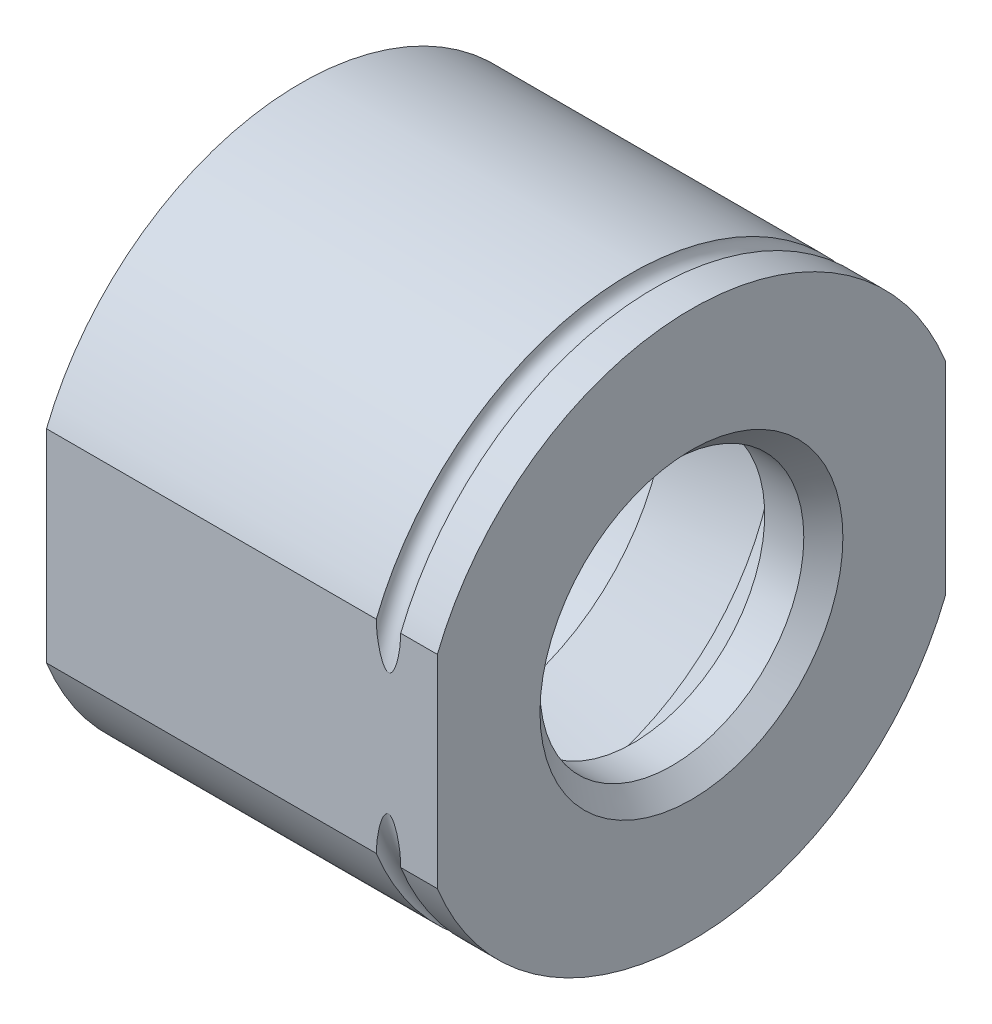
ISO-10303-21;
HEADER;
FILE_DESCRIPTION(('STEP AP214'),'2;1');
FILE_NAME('part.step','',(''),(''),'','','');
FILE_SCHEMA(('AUTOMOTIVE_DESIGN { 1 0 10303 214 1 1 1 1 }'));
ENDSEC;
DATA;
#1=APPLICATION_CONTEXT('core data for automotive mechanical design processes');
#2=APPLICATION_PROTOCOL_DEFINITION('international standard','automotive_design',2000,#1);
#3=PRODUCT_CONTEXT('',#1,'mechanical');
#4=PRODUCT('Part','Part','',(#3));
#5=PRODUCT_RELATED_PRODUCT_CATEGORY('part','',(#4));
#6=PRODUCT_DEFINITION_FORMATION('','',#4);
#7=PRODUCT_DEFINITION_CONTEXT('part definition',#1,'design');
#8=PRODUCT_DEFINITION('design','',#6,#7);
#9=PRODUCT_DEFINITION_SHAPE('','',#8);
#10=(LENGTH_UNIT() NAMED_UNIT(*) SI_UNIT(.MILLI.,.METRE.));
#11=(NAMED_UNIT(*) PLANE_ANGLE_UNIT() SI_UNIT($,.RADIAN.));
#12=(NAMED_UNIT(*) SI_UNIT($,.STERADIAN.) SOLID_ANGLE_UNIT());
#13=UNCERTAINTY_MEASURE_WITH_UNIT(LENGTH_MEASURE(1.E-05),#10,'distance_accuracy_value','');
#14=(GEOMETRIC_REPRESENTATION_CONTEXT(3) GLOBAL_UNCERTAINTY_ASSIGNED_CONTEXT((#13)) GLOBAL_UNIT_ASSIGNED_CONTEXT((#10,
#11,#12)) REPRESENTATION_CONTEXT('',''));
#15=CARTESIAN_POINT('',(0.,0.,0.));
#16=DIRECTION('',(0.,0.,1.));
#17=DIRECTION('',(1.,0.,0.));
#18=AXIS2_PLACEMENT_3D('',#15,#16,#17);
#19=CARTESIAN_POINT('',(-0.1016,0.,0.));
#20=DIRECTION('',(1.,0.,0.));
#21=DIRECTION('',(0.,0.,-1.));
#22=AXIS2_PLACEMENT_3D('',#19,#20,#21);
#23=CYLINDRICAL_SURFACE('',#22,1.42217319620361);
#24=DIRECTION('',(1.,0.,0.));
#25=VECTOR('',#24,1.);
#26=CARTESIAN_POINT('',(-0.1016,-0.527317703097479,-1.3208));
#27=LINE('',#26,#25);
#28=CARTESIAN_POINT('',(-0.1016,-0.527317703097479,-1.3208));
#29=VERTEX_POINT('',#28);
#30=CARTESIAN_POINT('',(1.6129,-0.527317703097479,-1.3208));
#31=VERTEX_POINT('',#30);
#32=EDGE_CURVE('E157',#29,#31,#27,.T.);
#33=ORIENTED_EDGE('',*,*,#32,.T.);
#34=CARTESIAN_POINT('',(1.6129,0.,0.));
#35=DIRECTION('',(-1.,0.,0.));
#36=DIRECTION('',(0.,0.,1.));
#37=AXIS2_PLACEMENT_3D('',#34,#35,#36);
#38=CIRCLE('',#37,1.42217319620361);
#39=CARTESIAN_POINT('',(1.6129,-0.527317703097479,1.3208));
#40=VERTEX_POINT('',#39);
#41=EDGE_CURVE('E78',#31,#40,#38,.T.);
#42=ORIENTED_EDGE('',*,*,#41,.T.);
#43=DIRECTION('',(1.,0.,0.));
#44=VECTOR('',#43,1.);
#45=CARTESIAN_POINT('',(-0.1016,-0.52731770309748,1.3208));
#46=LINE('',#45,#44);
#47=CARTESIAN_POINT('',(-0.1016,-0.52731770309748,1.3208));
#48=VERTEX_POINT('',#47);
#49=EDGE_CURVE('E149',#48,#40,#46,.T.);
#50=ORIENTED_EDGE('',*,*,#49,.F.);
#51=CARTESIAN_POINT('',(-0.1016,0.,0.));
#52=DIRECTION('',(1.,0.,0.));
#53=DIRECTION('',(0.,0.,-1.));
#54=AXIS2_PLACEMENT_3D('',#51,#52,#53);
#55=CIRCLE('',#54,1.42217319620361);
#56=EDGE_CURVE('E216',#48,#29,#55,.T.);
#57=ORIENTED_EDGE('',*,*,#56,.T.);
#58=EDGE_LOOP('',(#33,#42,#50,#57));
#59=FACE_BOUND('',#58,.T.);
#60=ADVANCED_FACE('F49',(#59),#23,.T.);
#61=CARTESIAN_POINT('',(1.7399,-0.527317703097479,1.3208));
#62=VERTEX_POINT('',#61);
#63=CARTESIAN_POINT('',(1.9304,-0.52731770309748,1.3208));
#64=VERTEX_POINT('',#63);
#65=EDGE_CURVE('E144',#62,#64,#46,.T.);
#66=ORIENTED_EDGE('',*,*,#65,.F.);
#67=CARTESIAN_POINT('',(1.7399,0.,0.));
#68=DIRECTION('',(-1.,0.,0.));
#69=DIRECTION('',(0.,0.,1.));
#70=AXIS2_PLACEMENT_3D('',#67,#68,#69);
#71=CIRCLE('',#70,1.42217319620361);
#72=CARTESIAN_POINT('',(1.7399,-0.527317703097479,-1.3208));
#73=VERTEX_POINT('',#72);
#74=EDGE_CURVE('E125',#73,#62,#71,.T.);
#75=ORIENTED_EDGE('',*,*,#74,.F.);
#76=CARTESIAN_POINT('',(1.9304,-0.527317703097479,-1.3208));
#77=VERTEX_POINT('',#76);
#78=EDGE_CURVE('E161',#73,#77,#27,.T.);
#79=ORIENTED_EDGE('',*,*,#78,.T.);
#80=CARTESIAN_POINT('',(1.9304,0.,0.));
#81=DIRECTION('',(1.,0.,0.));
#82=DIRECTION('',(0.,0.,-1.));
#83=AXIS2_PLACEMENT_3D('',#80,#81,#82);
#84=CIRCLE('',#83,1.42217319620361);
#85=EDGE_CURVE('E237',#64,#77,#84,.T.);
#86=ORIENTED_EDGE('',*,*,#85,.F.);
#87=EDGE_LOOP('',(#66,#75,#79,#86));
#88=FACE_BOUND('',#87,.T.);
#89=ADVANCED_FACE('F198',(#88),#23,.T.);
#90=CARTESIAN_POINT('',(-0.1016,0.527317703097479,1.3208));
#91=DIRECTION('',(0.,0.,1.));
#92=DIRECTION('',(1.,0.,0.));
#93=AXIS2_PLACEMENT_3D('',#90,#91,#92);
#94=PLANE('',#93);
#95=ORIENTED_EDGE('',*,*,#49,.T.);
#96=CARTESIAN_POINT('',(1.61327079992272,-0.508547522095153,1.3208));
#97=CARTESIAN_POINT('',(1.61410123201116,-0.487117532428304,1.3208));
#98=CARTESIAN_POINT('',(1.61627975921256,-0.465731752126961,1.3208));
#99=CARTESIAN_POINT('',(1.62138185103183,-0.43403056999215,1.3208));
#100=CARTESIAN_POINT('',(1.62338067178202,-0.423553308196953,1.3208));
#101=CARTESIAN_POINT('',(1.6280638385165,-0.40275481452524,1.3208));
#102=CARTESIAN_POINT('',(1.63074748955529,-0.392433435643484,1.3208));
#103=CARTESIAN_POINT('',(1.63546256570793,-0.377157917856461,1.3208));
#104=CARTESIAN_POINT('',(1.63715079474963,-0.372096594956818,1.3208));
#105=CARTESIAN_POINT('',(1.64084418063288,-0.362035815694534,1.3208));
#106=CARTESIAN_POINT('',(1.64285187204038,-0.357037231812776,1.3208));
#107=CARTESIAN_POINT('',(1.64733748589652,-0.347163535147122,1.3208));
#108=CARTESIAN_POINT('',(1.6498228688843,-0.342292000237766,1.3208));
#109=CARTESIAN_POINT('',(1.65551789037958,-0.332993263390576,1.3208));
#110=CARTESIAN_POINT('',(1.65871512718782,-0.328560135874237,1.3208));
#111=CARTESIAN_POINT('',(1.66355153874089,-0.324092145241062,1.3208));
#112=CARTESIAN_POINT('',(1.66447215226297,-0.323315443093113,1.3208));
#113=CARTESIAN_POINT('',(1.66640611453267,-0.321885735749664,1.3208));
#114=CARTESIAN_POINT('',(1.66741939369593,-0.321232638849707,1.3208));
#115=CARTESIAN_POINT('',(1.66933457313446,-0.320212696229645,1.3208));
#116=CARTESIAN_POINT('',(1.67021967432656,-0.319814866871306,1.3208));
#117=CARTESIAN_POINT('',(1.67204336047278,-0.319169284045743,1.3208));
#118=CARTESIAN_POINT('',(1.67298187194669,-0.318921329597116,1.3208));
#119=CARTESIAN_POINT('',(1.67489853209757,-0.31860428130753,1.3208));
#120=CARTESIAN_POINT('',(1.67587696392344,-0.318536837001317,1.3208));
#121=CARTESIAN_POINT('',(1.6778279065595,-0.318596097305675,1.3208));
#122=CARTESIAN_POINT('',(1.67880041661686,-0.318722826104412,1.3208));
#123=CARTESIAN_POINT('',(1.68058110971126,-0.319123573140062,1.3208));
#124=CARTESIAN_POINT('',(1.68139427801942,-0.31937642129739,1.3208));
#125=CARTESIAN_POINT('',(1.68297719383,-0.319992068501384,1.3208));
#126=CARTESIAN_POINT('',(1.6837469271034,-0.32035490333377,1.3208));
#127=CARTESIAN_POINT('',(1.68583739449962,-0.321492748366657,1.3208));
#128=CARTESIAN_POINT('',(1.68710485717128,-0.322364926868196,1.3208));
#129=CARTESIAN_POINT('',(1.68949839228136,-0.324285987804103,1.3208));
#130=CARTESIAN_POINT('',(1.69062389690994,-0.32533554287112,1.3208));
#131=CARTESIAN_POINT('',(1.69453607099004,-0.329374208686222,1.3208));
#132=CARTESIAN_POINT('',(1.69697751862376,-0.332689849075709,1.3208));
#133=CARTESIAN_POINT('',(1.70140708767815,-0.339609050012254,1.3208));
#134=CARTESIAN_POINT('',(1.70339208654412,-0.343214378586629,1.3208));
#135=CARTESIAN_POINT('',(1.70849759214814,-0.353443475618988,1.3208));
#136=CARTESIAN_POINT('',(1.71129602549062,-0.360228017415612,1.3208));
#137=CARTESIAN_POINT('',(1.71634479352295,-0.374001911644827,1.3208));
#138=CARTESIAN_POINT('',(1.71859370105788,-0.380991745647059,1.3208));
#139=CARTESIAN_POINT('',(1.72474020076049,-0.402145630129789,1.3208));
#140=CARTESIAN_POINT('',(1.72803340348204,-0.416484107399889,1.3208));
#141=CARTESIAN_POINT('',(1.73513153059778,-0.454348461118436,1.3208));
#142=CARTESIAN_POINT('',(1.73798650861486,-0.478055670215293,1.3208));
#143=CARTESIAN_POINT('',(1.73984052272239,-0.513721793580453,1.3208));
#144=CARTESIAN_POINT('',(1.74005388079704,-0.525626911185022,1.3208));
#145=CARTESIAN_POINT('',(1.7395168114693,-0.549412241893194,1.3208));
#146=CARTESIAN_POINT('',(1.73876746706724,-0.561292467948864,1.3208));
#147=CARTESIAN_POINT('',(1.73605017088207,-0.584950225018887,1.3208));
#148=CARTESIAN_POINT('',(1.73407846157779,-0.59672732539105,1.3208));
#149=CARTESIAN_POINT('',(1.72844424004516,-0.619887584482973,1.3208));
#150=CARTESIAN_POINT('',(1.72478991637334,-0.631272367255924,1.3208));
#151=CARTESIAN_POINT('',(1.71777383883732,-0.646241796367567,1.3208));
#152=CARTESIAN_POINT('',(1.71558154923911,-0.650365509435319,1.3208));
#153=CARTESIAN_POINT('',(1.71063667861031,-0.658260671854208,1.3208));
#154=CARTESIAN_POINT('',(1.70788637979442,-0.662033467580182,1.3208));
#155=CARTESIAN_POINT('',(1.70322222151157,-0.667209140761892,1.3208));
#156=CARTESIAN_POINT('',(1.701577896881,-0.668853646605565,1.3208));
#157=CARTESIAN_POINT('',(1.69808701509341,-0.671916081855663,1.3208));
#158=CARTESIAN_POINT('',(1.69624056819383,-0.673334133764535,1.3208));
#159=CARTESIAN_POINT('',(1.6926487891476,-0.675652533599948,1.3208));
#160=CARTESIAN_POINT('',(1.69093384795163,-0.67659931727464,1.3208));
#161=CARTESIAN_POINT('',(1.68737123338554,-0.67819930062222,1.3208));
#162=CARTESIAN_POINT('',(1.68552371641722,-0.678852839844647,1.3208));
#163=CARTESIAN_POINT('',(1.68171662867276,-0.679806399311097,1.3208));
#164=CARTESIAN_POINT('',(1.67975609549563,-0.680102687865833,1.3208));
#165=CARTESIAN_POINT('',(1.67581590524519,-0.680290279669111,1.3208));
#166=CARTESIAN_POINT('',(1.67383625938927,-0.680181807588212,1.3208));
#167=CARTESIAN_POINT('',(1.67024805390029,-0.679623931165019,1.3208));
#168=CARTESIAN_POINT('',(1.66863023861206,-0.679231037190397,1.3208));
#169=CARTESIAN_POINT('',(1.66547408176581,-0.678203392193641,1.3208));
#170=CARTESIAN_POINT('',(1.66393577656426,-0.677568531622616,1.3208));
#171=CARTESIAN_POINT('',(1.66025280634761,-0.675749674245639,1.3208));
#172=CARTESIAN_POINT('',(1.65816649669648,-0.67444803407407,1.3208));
#173=CARTESIAN_POINT('',(1.65422388166049,-0.671534214061854,1.3208));
#174=CARTESIAN_POINT('',(1.65236819178269,-0.669921231339192,1.3208));
#175=CARTESIAN_POINT('',(1.64768232182192,-0.665311077877855,1.3208));
#176=CARTESIAN_POINT('',(1.64504663381851,-0.662118019121602,1.3208));
#177=CARTESIAN_POINT('',(1.64026121906108,-0.655390452389046,1.3208));
#178=CARTESIAN_POINT('',(1.6381128481809,-0.651855029867408,1.3208));
#179=CARTESIAN_POINT('',(1.63218358567242,-0.640837936272729,1.3208));
#180=CARTESIAN_POINT('',(1.62899800247397,-0.633039490343991,1.3208));
#181=CARTESIAN_POINT('',(1.62368461339166,-0.617105700358118,1.3208));
#182=CARTESIAN_POINT('',(1.62155927700831,-0.608969617145235,1.3208));
#183=CARTESIAN_POINT('',(1.61663542783838,-0.585667721092861,1.3208));
#184=CARTESIAN_POINT('',(1.6147583774152,-0.570308703343404,1.3208));
#185=CARTESIAN_POINT('',(1.61277412663641,-0.539474773389508,1.3208));
#186=CARTESIAN_POINT('',(1.61267201535307,-0.52399965517009,1.3208));
#187=CARTESIAN_POINT('',(1.61327079992272,-0.508547522095153,1.3208));
#188=B_SPLINE_CURVE_WITH_KNOTS('',3,(#96,#97,#98,#99,#100,#101,#102,#103,#104,#105,#106,#107,
#108,#109,#110,#111,#112,#113,#114,#115,#116,#117,#118,#119,#120,#121,#122,#123,#124,#125,#126,
#127,#128,#129,#130,#131,#132,#133,#134,#135,#136,#137,#138,#139,#140,#141,#142,#143,#144,#145,
#146,#147,#148,#149,#150,#151,#152,#153,#154,#155,#156,#157,#158,#159,#160,#161,#162,#163,#164,
#165,#166,#167,#168,#169,#170,#171,#172,#173,#174,#175,#176,#177,#178,#179,#180,#181,#182,#183,
#184,#185,#186,#187),.UNSPECIFIED.,.T.,.F.,(4,2,2,2,2,2,2,2,2,2,2,2,2,2,2,2,2,2,2,2,2,2,2,2,2,2,
2,2,2,2,2,2,2,2,2,2,2,2,2,2,2,2,2,2,2,4),(0.,0.0643073680607315,0.0962943489159922,
0.128248998519312,0.144251576543813,0.160388104592895,0.176800834812584,0.192947342405822,
0.196553171577012,0.200156314955245,0.203056997418373,0.205953781402805,0.208876947765127,
0.211800478296221,0.214345885258932,0.216892121296326,0.221480731385624,0.226087149373269,
0.23834313845857,0.25068062907585,0.272641967714072,0.294659749257538,0.338727473877869,
0.410133303602389,0.445829402124988,0.481485379159332,0.517251509054085,0.552845390980571,
0.566828442449786,0.580755417192942,0.587717596303352,0.594675996303287,0.600531048279229,
0.606379303048142,0.612288131214861,0.618193680055287,0.623167172558658,0.628142919460163,
0.635478044167202,0.642832343504145,0.655183169500038,0.667567949113089,0.692698394737571,
0.717887103422975,0.764123501932235,0.810492446781076),.UNSPECIFIED.);
#189=EDGE_CURVE('E137',#40,#62,#188,.T.);
#190=ORIENTED_EDGE('',*,*,#189,.T.);
#191=ORIENTED_EDGE('',*,*,#65,.T.);
#192=DIRECTION('',(0.,-1.,0.));
#193=VECTOR('',#192,1.);
#194=CARTESIAN_POINT('',(1.9304,0.527317703097479,1.3208));
#195=LINE('',#194,#193);
#196=CARTESIAN_POINT('',(1.9304,0.527317703097479,1.3208));
#197=VERTEX_POINT('',#196);
#198=EDGE_CURVE('E231',#197,#64,#195,.T.);
#199=ORIENTED_EDGE('',*,*,#198,.F.);
#200=DIRECTION('',(1.,0.,0.));
#201=VECTOR('',#200,1.);
#202=CARTESIAN_POINT('',(-0.1016,0.527317703097479,1.3208));
#203=LINE('',#202,#201);
#204=CARTESIAN_POINT('',(1.7399,0.527317703097479,1.3208));
#205=VERTEX_POINT('',#204);
#206=EDGE_CURVE('E135',#205,#197,#203,.T.);
#207=ORIENTED_EDGE('',*,*,#206,.F.);
#208=CARTESIAN_POINT('',(1.67485270124336,0.318639997408028,1.3208));
#209=CARTESIAN_POINT('',(1.67386687935229,0.318742412070862,1.3208));
#210=CARTESIAN_POINT('',(1.67289151287556,0.318942869633638,1.3208));
#211=CARTESIAN_POINT('',(1.6709909606494,0.319511944215622,1.3208));
#212=CARTESIAN_POINT('',(1.67006588305181,0.319880908769566,1.3208));
#213=CARTESIAN_POINT('',(1.6679035724575,0.320931599129008,1.3208));
#214=CARTESIAN_POINT('',(1.66669910547798,0.321679602685286,1.3208));
#215=CARTESIAN_POINT('',(1.66441676867692,0.323347044128238,1.3208));
#216=CARTESIAN_POINT('',(1.66333922271222,0.324266905718393,1.3208));
#217=CARTESIAN_POINT('',(1.65976205630876,0.32766536088741,1.3208));
#218=CARTESIAN_POINT('',(1.65753516851105,0.330424700878596,1.3208));
#219=CARTESIAN_POINT('',(1.65347270508397,0.336217653500864,1.3208));
#220=CARTESIAN_POINT('',(1.65163986768691,0.339252989168973,1.3208));
#221=CARTESIAN_POINT('',(1.64700788868944,0.347708258443656,1.3208));
#222=CARTESIAN_POINT('',(1.64446576005205,0.353268484780056,1.3208));
#223=CARTESIAN_POINT('',(1.63984056234651,0.364579721034463,1.3208));
#224=CARTESIAN_POINT('',(1.63775868854174,0.370331184091349,1.3208));
#225=CARTESIAN_POINT('',(1.63200180210707,0.387759239285524,1.3208));
#226=CARTESIAN_POINT('',(1.62882028640237,0.399599160587468,1.3208));
#227=CARTESIAN_POINT('',(1.62337439221561,0.423408202017514,1.3208));
#228=CARTESIAN_POINT('',(1.6211051949246,0.435376291119901,1.3208));
#229=CARTESIAN_POINT('',(1.61736768752501,0.459452231922754,1.3208));
#230=CARTESIAN_POINT('',(1.61590027771416,0.471560225208688,1.3208));
#231=CARTESIAN_POINT('',(1.61378576345627,0.495846706802483,1.3208));
#232=CARTESIAN_POINT('',(1.61313859737155,0.508025189744261,1.3208));
#233=CARTESIAN_POINT('',(1.61276954310186,0.532395607084063,1.3208));
#234=CARTESIAN_POINT('',(1.61304713822346,0.544587530166974,1.3208));
#235=CARTESIAN_POINT('',(1.61485487416913,0.570648211961541,1.3208));
#236=CARTESIAN_POINT('',(1.61656016285556,0.584504779766506,1.3208));
#237=CARTESIAN_POINT('',(1.62201897244385,0.611814654817939,1.3208));
#238=CARTESIAN_POINT('',(1.62575875685203,0.625270035234794,1.3208));
#239=CARTESIAN_POINT('',(1.63311094710097,0.642331980961519,1.3208));
#240=CARTESIAN_POINT('',(1.63518503453793,0.646588546940789,1.3208));
#241=CARTESIAN_POINT('',(1.63986818218345,0.654797709817243,1.3208));
#242=CARTESIAN_POINT('',(1.64247577349738,0.658751101208217,1.3208));
#243=CARTESIAN_POINT('',(1.64704690388863,0.6644455139038,1.3208));
#244=CARTESIAN_POINT('',(1.64876911710487,0.666379074235364,1.3208));
#245=CARTESIAN_POINT('',(1.65245364028426,0.67000652980535,1.3208));
#246=CARTESIAN_POINT('',(1.65441576698252,0.671700605874049,1.3208));
#247=CARTESIAN_POINT('',(1.6581541374291,0.674416076951593,1.3208));
#248=CARTESIAN_POINT('',(1.6598815407574,0.675503937414628,1.3208));
#249=CARTESIAN_POINT('',(1.66348905051617,0.677388437120524,1.3208));
#250=CARTESIAN_POINT('',(1.66536888772262,0.678185576698707,1.3208));
#251=CARTESIAN_POINT('',(1.66891061067837,0.679306623474783,1.3208));
#252=CARTESIAN_POINT('',(1.67055396687525,0.679688530183748,1.3208));
#253=CARTESIAN_POINT('',(1.67388169024811,0.68016817357055,1.3208));
#254=CARTESIAN_POINT('',(1.67556603050335,0.680266091964701,1.3208));
#255=CARTESIAN_POINT('',(1.67892664750177,0.680168318935855,1.3208));
#256=CARTESIAN_POINT('',(1.68060292078759,0.679972511225546,1.3208));
#257=CARTESIAN_POINT('',(1.68389973751802,0.679306007919346,1.3208));
#258=CARTESIAN_POINT('',(1.68552023645758,0.678835097955042,1.3208));
#259=CARTESIAN_POINT('',(1.68913419244172,0.677483140695746,1.3208));
#260=CARTESIAN_POINT('',(1.69109759177292,0.676522300117137,1.3208));
#261=CARTESIAN_POINT('',(1.69484426913914,0.674298516253261,1.3208));
#262=CARTESIAN_POINT('',(1.69662717239449,0.673034962006437,1.3208));
#263=CARTESIAN_POINT('',(1.70098712123166,0.669497818975332,1.3208));
#264=CARTESIAN_POINT('',(1.70343086447325,0.667061385910786,1.3208));
#265=CARTESIAN_POINT('',(1.70793170846882,0.661856923542702,1.3208));
#266=CARTESIAN_POINT('',(1.70998773326133,0.659088005377836,1.3208));
#267=CARTESIAN_POINT('',(1.7155406576783,0.650683494144398,1.3208));
#268=CARTESIAN_POINT('',(1.71860883735985,0.644767620085065,1.3208));
#269=CARTESIAN_POINT('',(1.7239154669005,0.632588373320861,1.3208));
#270=CARTESIAN_POINT('',(1.72615221175215,0.626324316495643,1.3208));
#271=CARTESIAN_POINT('',(1.73235119315264,0.605922326338034,1.3208));
#272=CARTESIAN_POINT('',(1.73512621212539,0.591428690876174,1.3208));
#273=CARTESIAN_POINT('',(1.73880530862914,0.562169813958327,1.3208));
#274=CARTESIAN_POINT('',(1.73969710334,0.547403419225165,1.3208));
#275=CARTESIAN_POINT('',(1.74004019012186,0.517947737283945,1.3208));
#276=CARTESIAN_POINT('',(1.7395003636086,0.503258538487747,1.3208));
#277=CARTESIAN_POINT('',(1.73722348673311,0.473972425036437,1.3208));
#278=CARTESIAN_POINT('',(1.73548610614998,0.459375536956306,1.3208));
#279=CARTESIAN_POINT('',(1.73085795576051,0.430483409135114,1.3208));
#280=CARTESIAN_POINT('',(1.72797594151972,0.416186727586896,1.3208));
#281=CARTESIAN_POINT('',(1.7208916075669,0.38793826477456,1.3208));
#282=CARTESIAN_POINT('',(1.71669406773519,0.37398542906251,1.3208));
#283=CARTESIAN_POINT('',(1.71016635336418,0.357711152939245,1.3208));
#284=CARTESIAN_POINT('',(1.70899430032861,0.354938760191774,1.3208));
#285=CARTESIAN_POINT('',(1.70650600989737,0.349459448066692,1.3208));
#286=CARTESIAN_POINT('',(1.70518952407086,0.346752651595668,1.3208));
#287=CARTESIAN_POINT('',(1.70080069063145,0.338394182886188,1.3208));
#288=CARTESIAN_POINT('',(1.69742000331662,0.332857472000263,1.3208));
#289=CARTESIAN_POINT('',(1.69231820163847,0.327076676955551,1.3208));
#290=CARTESIAN_POINT('',(1.69141952774781,0.326129138198481,1.3208));
#291=CARTESIAN_POINT('',(1.68952731085036,0.324328750697798,1.3208));
#292=CARTESIAN_POINT('',(1.68853360723617,0.323476067721503,1.3208));
#293=CARTESIAN_POINT('',(1.68642302544908,0.321899535857425,1.3208));
#294=CARTESIAN_POINT('',(1.68530454366573,0.321177777673098,1.3208));
#295=CARTESIAN_POINT('',(1.68295252344134,0.319956273786091,1.3208));
#296=CARTESIAN_POINT('',(1.68171951920497,0.319455554327663,1.3208));
#297=CARTESIAN_POINT('',(1.67953604706088,0.318862173137515,1.3208));
#298=CARTESIAN_POINT('',(1.67860652234646,0.318693510335914,1.3208));
#299=CARTESIAN_POINT('',(1.67673242080308,0.318533919329986,1.3208));
#300=CARTESIAN_POINT('',(1.67578785686291,0.31854284634216,1.3208));
#301=CARTESIAN_POINT('',(1.67485270124336,0.318639997408028,1.3208));
#302=B_SPLINE_CURVE_WITH_KNOTS('',3,(#208,#209,#210,#211,#212,#213,#214,#215,#216,#217,#218,
#219,#220,#221,#222,#223,#224,#225,#226,#227,#228,#229,#230,#231,#232,#233,#234,#235,#236,#237,
#238,#239,#240,#241,#242,#243,#244,#245,#246,#247,#248,#249,#250,#251,#252,#253,#254,#255,#256,
#257,#258,#259,#260,#261,#262,#263,#264,#265,#266,#267,#268,#269,#270,#271,#272,#273,#274,#275,
#276,#277,#278,#279,#280,#281,#282,#283,#284,#285,#286,#287,#288,#289,#290,#291,#292,#293,#294,
#295,#296,#297,#298,#299,#300,#301),.UNSPECIFIED.,.T.,.F.,(4,2,2,2,2,2,2,2,2,2,2,2,2,2,2,2,2,2,
2,2,2,2,2,2,2,2,2,2,2,2,2,2,2,2,2,2,2,2,2,2,2,2,2,2,2,2,4),(0.,0.00296910834186236,
0.0059443681251479,0.0101736245207005,0.0144134488285887,0.0249691033128915,0.0355958935418746,
0.0538905174271889,0.0722321077251544,0.108949214530345,0.145469752273428,0.182031213754402,
0.218589927640682,0.255128218439543,0.296944773291562,0.33848243356271,0.35266283998346,
0.366804716616884,0.374556973965302,0.382303346094276,0.388406746755628,0.394499593237477,
0.399538750624888,0.404574682881903,0.409612609410458,0.414654466897612,0.421175477156502,
0.427709761205372,0.438003659392266,0.448325716911143,0.468205904282348,0.488126637559675,
0.532152778338705,0.576465191910785,0.620503346532936,0.664553649366529,0.708273297856483,
0.75183590021912,0.760859512587428,0.76989889679905,0.789113784323038,0.793026381943539,
0.796945713118461,0.800922978837073,0.804882544010865,0.807701353157664,0.81051786431053),.UNSPECIFIED.);
#303=CARTESIAN_POINT('',(1.6129,0.527317703097479,1.3208));
#304=VERTEX_POINT('',#303);
#305=EDGE_CURVE('E120',#205,#304,#302,.T.);
#306=ORIENTED_EDGE('',*,*,#305,.T.);
#307=CARTESIAN_POINT('',(-0.1016,0.527317703097479,1.3208));
#308=VERTEX_POINT('',#307);
#309=EDGE_CURVE('E132',#308,#304,#203,.T.);
#310=ORIENTED_EDGE('',*,*,#309,.F.);
#311=DIRECTION('',(0.,-1.,0.));
#312=VECTOR('',#311,1.);
#313=CARTESIAN_POINT('',(-0.1016,0.527317703097479,1.3208));
#314=LINE('',#313,#312);
#315=EDGE_CURVE('E229',#308,#48,#314,.T.);
#316=ORIENTED_EDGE('',*,*,#315,.T.);
#317=EDGE_LOOP('',(#95,#190,#191,#199,#207,#306,#310,#316));
#318=FACE_BOUND('',#317,.T.);
#319=ADVANCED_FACE('F130',(#318),#94,.T.);
#320=CARTESIAN_POINT('',(-0.1016,0.,0.));
#321=DIRECTION('',(1.,0.,0.));
#322=DIRECTION('',(0.,0.,-1.));
#323=AXIS2_PLACEMENT_3D('',#320,#321,#322);
#324=CYLINDRICAL_SURFACE('',#323,1.42217319620361);
#325=ORIENTED_EDGE('',*,*,#309,.T.);
#326=CARTESIAN_POINT('',(1.6129,0.527317703097479,-1.3208));
#327=VERTEX_POINT('',#326);
#328=EDGE_CURVE('E117',#304,#327,#38,.T.);
#329=ORIENTED_EDGE('',*,*,#328,.T.);
#330=DIRECTION('',(1.,0.,0.));
#331=VECTOR('',#330,1.);
#332=CARTESIAN_POINT('',(-0.1016,0.52731770309748,-1.3208));
#333=LINE('',#332,#331);
#334=CARTESIAN_POINT('',(-0.1016,0.52731770309748,-1.3208));
#335=VERTEX_POINT('',#334);
#336=EDGE_CURVE('E151',#335,#327,#333,.T.);
#337=ORIENTED_EDGE('',*,*,#336,.F.);
#338=CARTESIAN_POINT('',(-0.1016,0.,0.));
#339=DIRECTION('',(1.,0.,0.));
#340=DIRECTION('',(0.,0.,-1.));
#341=AXIS2_PLACEMENT_3D('',#338,#339,#340);
#342=CIRCLE('',#341,1.42217319620361);
#343=EDGE_CURVE('E141',#335,#308,#342,.T.);
#344=ORIENTED_EDGE('',*,*,#343,.T.);
#345=EDGE_LOOP('',(#325,#329,#337,#344));
#346=FACE_BOUND('',#345,.T.);
#347=ADVANCED_FACE('F139',(#346),#324,.T.);
#348=CARTESIAN_POINT('',(1.7399,0.52731770309748,-1.3208));
#349=VERTEX_POINT('',#348);
#350=CARTESIAN_POINT('',(1.9304,0.52731770309748,-1.3208));
#351=VERTEX_POINT('',#350);
#352=EDGE_CURVE('E156',#349,#351,#333,.T.);
#353=ORIENTED_EDGE('',*,*,#352,.F.);
#354=EDGE_CURVE('E70',#205,#349,#71,.T.);
#355=ORIENTED_EDGE('',*,*,#354,.F.);
#356=ORIENTED_EDGE('',*,*,#206,.T.);
#357=CARTESIAN_POINT('',(1.9304,0.,0.));
#358=DIRECTION('',(1.,0.,0.));
#359=DIRECTION('',(0.,0.,-1.));
#360=AXIS2_PLACEMENT_3D('',#357,#358,#359);
#361=CIRCLE('',#360,1.42217319620361);
#362=EDGE_CURVE('E246',#351,#197,#361,.T.);
#363=ORIENTED_EDGE('',*,*,#362,.F.);
#364=EDGE_LOOP('',(#353,#355,#356,#363));
#365=FACE_BOUND('',#364,.T.);
#366=ADVANCED_FACE('F203',(#365),#324,.T.);
#367=CARTESIAN_POINT('',(-0.1016,-0.527317703097479,-1.3208));
#368=DIRECTION('',(0.,0.,-1.));
#369=DIRECTION('',(-1.,0.,0.));
#370=AXIS2_PLACEMENT_3D('',#367,#368,#369);
#371=PLANE('',#370);
#372=ORIENTED_EDGE('',*,*,#78,.F.);
#373=CARTESIAN_POINT('',(1.61327079992272,-0.508547522095152,-1.3208));
#374=CARTESIAN_POINT('',(1.61261675839651,-0.525415150751983,-1.3208));
#375=CARTESIAN_POINT('',(1.61279822570286,-0.542310168696948,-1.3208));
#376=CARTESIAN_POINT('',(1.61533279389331,-0.57600415215576,-1.3208));
#377=CARTESIAN_POINT('',(1.6176855526725,-0.592803132381609,-1.3208));
#378=CARTESIAN_POINT('',(1.62380091420713,-0.61742472619507,-1.3208));
#379=CARTESIAN_POINT('',(1.62628316317367,-0.62556216477486,-1.3208));
#380=CARTESIAN_POINT('',(1.63247664988756,-0.641362607602067,-1.3208));
#381=CARTESIAN_POINT('',(1.63618054255279,-0.649028130045487,-1.3208));
#382=CARTESIAN_POINT('',(1.64275183345288,-0.659005414192534,-1.3208));
#383=CARTESIAN_POINT('',(1.64483893368214,-0.66182363839497,-1.3208));
#384=CARTESIAN_POINT('',(1.64941445650297,-0.667113124486188,-1.3208));
#385=CARTESIAN_POINT('',(1.6519014298823,-0.669585581172132,-1.3208));
#386=CARTESIAN_POINT('',(1.65619095129826,-0.673039834902514,-1.3208));
#387=CARTESIAN_POINT('',(1.65784024417646,-0.674210725154705,-1.3208));
#388=CARTESIAN_POINT('',(1.66129570582234,-0.676297390403908,-1.3208));
#389=CARTESIAN_POINT('',(1.6631018161375,-0.677213259927004,-1.3208));
#390=CARTESIAN_POINT('',(1.66687391620868,-0.678723598499577,-1.3208));
#391=CARTESIAN_POINT('',(1.66884164177121,-0.679313848179492,-1.3208));
#392=CARTESIAN_POINT('',(1.67285537887436,-0.680082822674359,-1.3208));
#393=CARTESIAN_POINT('',(1.67490124875669,-0.680262259269559,-1.3208));
#394=CARTESIAN_POINT('',(1.67867023877508,-0.680192471923984,-1.3208));
#395=CARTESIAN_POINT('',(1.68039477795226,-0.680004718614173,-1.3208));
#396=CARTESIAN_POINT('',(1.68378656912692,-0.679337886354141,-1.3208));
#397=CARTESIAN_POINT('',(1.68545377862022,-0.678858595977387,-1.3208));
#398=CARTESIAN_POINT('',(1.68911066849086,-0.677493634492949,-1.3208));
#399=CARTESIAN_POINT('',(1.69107288716969,-0.676535114722883,-1.3208));
#400=CARTESIAN_POINT('',(1.69481745730647,-0.674316263426883,-1.3208));
#401=CARTESIAN_POINT('',(1.69659945978365,-0.673055361680976,-1.3208));
#402=CARTESIAN_POINT('',(1.70095678358107,-0.66952567836429,-1.3208));
#403=CARTESIAN_POINT('',(1.70339913644134,-0.667094234716396,-1.3208));
#404=CARTESIAN_POINT('',(1.70789786741665,-0.661899839455997,-1.3208));
#405=CARTESIAN_POINT('',(1.70995317339191,-0.659136000767843,-1.3208));
#406=CARTESIAN_POINT('',(1.7155024952739,-0.650749537431913,-1.3208));
#407=CARTESIAN_POINT('',(1.71856906328822,-0.644847043306452,-1.3208));
#408=CARTESIAN_POINT('',(1.72387507500211,-0.632692603463453,-1.3208));
#409=CARTESIAN_POINT('',(1.72611254465239,-0.626439864021009,-1.3208));
#410=CARTESIAN_POINT('',(1.73231816215948,-0.606064450352967,-1.3208));
#411=CARTESIAN_POINT('',(1.73509881841223,-0.591585095724777,-1.3208));
#412=CARTESIAN_POINT('',(1.73878582752574,-0.562384449858067,-1.3208));
#413=CARTESIAN_POINT('',(1.73968379974247,-0.547662369627248,-1.3208));
#414=CARTESIAN_POINT('',(1.74004566923088,-0.518334734819648,-1.3208));
#415=CARTESIAN_POINT('',(1.73952244034649,-0.50372932819075,-1.3208));
#416=CARTESIAN_POINT('',(1.73728732279893,-0.474613681863551,-1.3208));
#417=CARTESIAN_POINT('',(1.73557516444021,-0.460103464511899,-1.3208));
#418=CARTESIAN_POINT('',(1.73099951949949,-0.431203605143025,-1.3208));
#419=CARTESIAN_POINT('',(1.72813190673275,-0.416814585959437,-1.3208));
#420=CARTESIAN_POINT('',(1.72279392929205,-0.395519464923004,-1.3208));
#421=CARTESIAN_POINT('',(1.72084581143536,-0.388480267521818,-1.3208));
#422=CARTESIAN_POINT('',(1.71651368849237,-0.374538097732196,-1.3208));
#423=CARTESIAN_POINT('',(1.71413025334996,-0.367634960147981,-1.3208));
#424=CARTESIAN_POINT('',(1.70908757404103,-0.354988471325973,-1.3208));
#425=CARTESIAN_POINT('',(1.7065065674049,-0.349212530076248,-1.3208));
#426=CARTESIAN_POINT('',(1.70060710677091,-0.338082071064138,-1.3208));
#427=CARTESIAN_POINT('',(1.69730099595418,-0.332722322972923,-1.3208));
#428=CARTESIAN_POINT('',(1.69230264360473,-0.327059108472001,-1.3208));
#429=CARTESIAN_POINT('',(1.69138800762071,-0.326096027259112,-1.3208));
#430=CARTESIAN_POINT('',(1.68945946536391,-0.324267573313267,-1.3208));
#431=CARTESIAN_POINT('',(1.68844529718644,-0.323402472006079,-1.3208));
#432=CARTESIAN_POINT('',(1.68628803969841,-0.321807276387492,-1.3208));
#433=CARTESIAN_POINT('',(1.68514317503171,-0.321079517057925,-1.3208));
#434=CARTESIAN_POINT('',(1.68273466226995,-0.319859801727911,-1.3208));
#435=CARTESIAN_POINT('',(1.68147166290634,-0.319366639053292,-1.3208));
#436=CARTESIAN_POINT('',(1.67933272320696,-0.318824946354552,-1.3208));
#437=CARTESIAN_POINT('',(1.67848117838574,-0.318680253541753,-1.3208));
#438=CARTESIAN_POINT('',(1.67676580426602,-0.31853947675197,-1.3208));
#439=CARTESIAN_POINT('',(1.67590198204174,-0.318543310408679,-1.3208));
#440=CARTESIAN_POINT('',(1.67418971355092,-0.318699042234939,-1.3208));
#441=CARTESIAN_POINT('',(1.67334124344834,-0.318850686379354,-1.3208));
#442=CARTESIAN_POINT('',(1.67167864810388,-0.319285081459442,-1.3208));
#443=CARTESIAN_POINT('',(1.6708645614071,-0.319567975486696,-1.3208));
#444=CARTESIAN_POINT('',(1.66888185938026,-0.320411215344878,-1.3208));
#445=CARTESIAN_POINT('',(1.66774241979139,-0.321039518231935,-1.3208));
#446=CARTESIAN_POINT('',(1.66557300386122,-0.322462319607805,-1.3208));
#447=CARTESIAN_POINT('',(1.66454335724768,-0.323257298562128,-1.3208));
#448=CARTESIAN_POINT('',(1.66166659781267,-0.325747275621808,-1.3208));
#449=CARTESIAN_POINT('',(1.65995050602971,-0.327591332865354,-1.3208));
#450=CARTESIAN_POINT('',(1.65677311983919,-0.331484873419872,-1.3208));
#451=CARTESIAN_POINT('',(1.65531271967591,-0.333535039719164,-1.3208));
#452=CARTESIAN_POINT('',(1.64914765295724,-0.342967479110732,-1.3208));
#453=CARTESIAN_POINT('',(1.64539154791257,-0.350949159750343,-1.3208));
#454=CARTESIAN_POINT('',(1.63876733396432,-0.367259863421521,-1.3208));
#455=CARTESIAN_POINT('',(1.6359048606686,-0.375590729343609,-1.3208));
#456=CARTESIAN_POINT('',(1.63029348169723,-0.394103647322996,-1.3208));
#457=CARTESIAN_POINT('',(1.6276773540404,-0.404327858124693,-1.3208));
#458=CARTESIAN_POINT('',(1.62310830333054,-0.424924959947907,-1.3208));
#459=CARTESIAN_POINT('',(1.62115616324959,-0.43529801157053,-1.3208));
#460=CARTESIAN_POINT('',(1.61620210504112,-0.466513296283818,-1.3208));
#461=CARTESIAN_POINT('',(1.61408656358623,-0.487509104813605,-1.3208));
#462=CARTESIAN_POINT('',(1.61327079992272,-0.508547522095152,-1.3208));
#463=B_SPLINE_CURVE_WITH_KNOTS('',3,(#373,#374,#375,#376,#377,#378,#379,#380,#381,#382,#383,
#384,#385,#386,#387,#388,#389,#390,#391,#392,#393,#394,#395,#396,#397,#398,#399,#400,#401,#402,
#403,#404,#405,#406,#407,#408,#409,#410,#411,#412,#413,#414,#415,#416,#417,#418,#419,#420,#421,
#422,#423,#424,#425,#426,#427,#428,#429,#430,#431,#432,#433,#434,#435,#436,#437,#438,#439,#440,
#441,#442,#443,#444,#445,#446,#447,#448,#449,#450,#451,#452,#453,#454,#455,#456,#457,#458,#459,
#460,#461,#462),.UNSPECIFIED.,.T.,.F.,(4,2,2,2,2,2,2,2,2,2,2,2,2,2,2,2,2,2,2,2,2,2,2,2,2,2,2,2,
2,2,2,2,2,2,2,2,2,2,2,2,2,2,2,2,4),(0.,0.0506172059802219,0.101226438162386,0.126703020855219,
0.152029136998985,0.162524402412534,0.172982454648954,0.179033184832697,0.185081669255788,
0.19120679152256,0.197321293263081,0.202498869140472,0.2076802043485,0.21419526493456,
0.220722709333759,0.231003185962656,0.241311734114513,0.261154308355138,0.281043827925715,
0.325030588405114,0.369212740905936,0.41299601056582,0.456789215223448,0.500740213553926,
0.522645253795957,0.544521817577181,0.563503387051158,0.582183954228778,0.586162820724435,
0.590152453047862,0.594204775074121,0.598236021910294,0.600815618269995,0.603393784118471,
0.605967526963568,0.608544082378617,0.612425097655295,0.616317458188984,0.623832277100788,
0.631372874650458,0.657637313779756,0.684064189045196,0.715682567735957,0.747338102498471,
0.810471215202293),.UNSPECIFIED.);
#464=EDGE_CURVE('E11',#73,#31,#463,.T.);
#465=ORIENTED_EDGE('',*,*,#464,.T.);
#466=ORIENTED_EDGE('',*,*,#32,.F.);
#467=DIRECTION('',(0.,1.,0.));
#468=VECTOR('',#467,1.);
#469=CARTESIAN_POINT('',(-0.1016,-0.527317703097479,-1.3208));
#470=LINE('',#469,#468);
#471=EDGE_CURVE('E221',#29,#335,#470,.T.);
#472=ORIENTED_EDGE('',*,*,#471,.T.);
#473=ORIENTED_EDGE('',*,*,#336,.T.);
#474=CARTESIAN_POINT('',(1.6764,0.318559592670102,-1.3208));
#475=CARTESIAN_POINT('',(1.67746282282419,0.318559898164679,-1.3208));
#476=CARTESIAN_POINT('',(1.67852717484704,0.318675499118343,-1.3208));
#477=CARTESIAN_POINT('',(1.68061158329735,0.319118449807695,-1.3208));
#478=CARTESIAN_POINT('',(1.68163148217041,0.319446496184389,-1.3208));
#479=CARTESIAN_POINT('',(1.68383367348967,0.320366559166432,-1.3208));
#480=CARTESIAN_POINT('',(1.68499705442182,0.321002748471865,-1.3208));
#481=CARTESIAN_POINT('',(1.68720932583006,0.322447896992667,-1.3208));
#482=CARTESIAN_POINT('',(1.68825796824675,0.32325721977894,-1.3208));
#483=CARTESIAN_POINT('',(1.69115224123134,0.325765979759885,-1.3208));
#484=CARTESIAN_POINT('',(1.69286836733073,0.327612321330147,-1.3208));
#485=CARTESIAN_POINT('',(1.6960455933164,0.331509911545597,-1.3208));
#486=CARTESIAN_POINT('',(1.69750585047296,0.333561803568967,-1.3208));
#487=CARTESIAN_POINT('',(1.70367490150245,0.343008249902559,-1.3208));
#488=CARTESIAN_POINT('',(1.70743392502109,0.351002408371645,-1.3208));
#489=CARTESIAN_POINT('',(1.71406451532974,0.367347094354705,-1.3208));
#490=CARTESIAN_POINT('',(1.71692953410766,0.375699763931804,-1.3208));
#491=CARTESIAN_POINT('',(1.72353086088359,0.397490792350752,-1.3208));
#492=CARTESIAN_POINT('',(1.72681075524,0.411072823552474,-1.3208));
#493=CARTESIAN_POINT('',(1.73228408484013,0.438465738579043,-1.3208));
#494=CARTESIAN_POINT('',(1.73447523322759,0.452277041664371,-1.3208));
#495=CARTESIAN_POINT('',(1.73779943978351,0.479985447982938,-1.3208));
#496=CARTESIAN_POINT('',(1.73893583518397,0.493882139593466,-1.3208));
#497=CARTESIAN_POINT('',(1.74006325935305,0.521720860536844,-1.3208));
#498=CARTESIAN_POINT('',(1.74005491072215,0.53566286110098,-1.3208));
#499=CARTESIAN_POINT('',(1.73864866299022,0.563093385773187,-1.3208));
#500=CARTESIAN_POINT('',(1.73728902588302,0.576583827130001,-1.3208));
#501=CARTESIAN_POINT('',(1.73276670764172,0.603316827976804,-1.3208));
#502=CARTESIAN_POINT('',(1.72960514078063,0.616559535437883,-1.3208));
#503=CARTESIAN_POINT('',(1.72266505432828,0.635714178167182,-1.3208));
#504=CARTESIAN_POINT('',(1.71996562455298,0.642011538755337,-1.3208));
#505=CARTESIAN_POINT('',(1.71352528798574,0.654048301707908,-1.3208));
#506=CARTESIAN_POINT('',(1.70979316226215,0.659791880767819,-1.3208));
#507=CARTESIAN_POINT('',(1.7035192547795,0.666919292968381,-1.3208));
#508=CARTESIAN_POINT('',(1.70160795160923,0.668850422477783,-1.3208));
#509=CARTESIAN_POINT('',(1.69750980143018,0.672395989505301,-1.3208));
#510=CARTESIAN_POINT('',(1.69532364765341,0.674011198525089,-1.3208));
#511=CARTESIAN_POINT('',(1.69141151809986,0.676337842863266,-1.3208));
#512=CARTESIAN_POINT('',(1.68975991242957,0.677173390195303,-1.3208));
#513=CARTESIAN_POINT('',(1.68634336120977,0.678569740218007,-1.3208));
#514=CARTESIAN_POINT('',(1.68457852038871,0.679130792754453,-1.3208));
#515=CARTESIAN_POINT('',(1.68095996013051,0.679928855181258,-1.3208));
#516=CARTESIAN_POINT('',(1.67910562977794,0.680163165865573,-1.3208));
#517=CARTESIAN_POINT('',(1.67538661905793,0.680271257673377,-1.3208));
#518=CARTESIAN_POINT('',(1.67352194234119,0.680145158781651,-1.3208));
#519=CARTESIAN_POINT('',(1.67005369906187,0.679581446413938,-1.3208));
#520=CARTESIAN_POINT('',(1.66844404657174,0.679179791796388,-1.3208));
#521=CARTESIAN_POINT('',(1.66530471926509,0.678137727842494,-1.3208));
#522=CARTESIAN_POINT('',(1.66377508619942,0.677497195258649,-1.3208));
#523=CARTESIAN_POINT('',(1.66009257576778,0.67565751751504,-1.3208));
#524=CARTESIAN_POINT('',(1.65799990724639,0.674338314468909,-1.3208));
#525=CARTESIAN_POINT('',(1.65404710106793,0.671388867371109,-1.3208));
#526=CARTESIAN_POINT('',(1.65218759699662,0.669757804976597,-1.3208));
#527=CARTESIAN_POINT('',(1.64748551186444,0.665091189279619,-1.3208));
#528=CARTESIAN_POINT('',(1.6448406943309,0.661858176751622,-1.3208));
#529=CARTESIAN_POINT('',(1.64004220318495,0.655050233151398,-1.3208));
#530=CARTESIAN_POINT('',(1.63788990557612,0.651474382820064,-1.3208));
#531=CARTESIAN_POINT('',(1.63194429680775,0.640317583277945,-1.3208));
#532=CARTESIAN_POINT('',(1.62875512301238,0.632418266588115,-1.3208));
#533=CARTESIAN_POINT('',(1.62344936534525,0.616285001958742,-1.3208));
#534=CARTESIAN_POINT('',(1.62133503946618,0.60805038849247,-1.3208));
#535=CARTESIAN_POINT('',(1.61573703364884,0.581059826872358,-1.3208));
#536=CARTESIAN_POINT('',(1.61383036037018,0.561980452370429,-1.3208));
#537=CARTESIAN_POINT('',(1.61250562003447,0.523695744658882,-1.3208));
#538=CARTESIAN_POINT('',(1.61310318479804,0.504490369654553,-1.3208));
#539=CARTESIAN_POINT('',(1.61656286180668,0.463077473160361,-1.3208));
#540=CARTESIAN_POINT('',(1.61978158523499,0.44089622352992,-1.3208));
#541=CARTESIAN_POINT('',(1.62674382978658,0.408190063299631,-1.3208));
#542=CARTESIAN_POINT('',(1.62940528010743,0.397424652216446,-1.3208));
#543=CARTESIAN_POINT('',(1.63563823545418,0.376167241776852,-1.3208));
#544=CARTESIAN_POINT('',(1.63920752085833,0.365674643402337,-1.3208));
#545=CARTESIAN_POINT('',(1.64582054111432,0.35032424643533,-1.3208));
#546=CARTESIAN_POINT('',(1.64826611936087,0.34522262277497,-1.3208));
#547=CARTESIAN_POINT('',(1.65259246206007,0.337687072319052,-1.3208));
#548=CARTESIAN_POINT('',(1.65421471386821,0.335106522058899,-1.3208));
#549=CARTESIAN_POINT('',(1.65776714519973,0.330165451418244,-1.3208));
#550=CARTESIAN_POINT('',(1.65969598163453,0.327804039386337,-1.3208));
#551=CARTESIAN_POINT('',(1.66273063362498,0.324825341738694,-1.3208));
#552=CARTESIAN_POINT('',(1.66363892275283,0.324009470356734,-1.3208));
#553=CARTESIAN_POINT('',(1.6655470640211,0.322490194498892,-1.3208));
#554=CARTESIAN_POINT('',(1.66654688326951,0.321786749869238,-1.3208));
#555=CARTESIAN_POINT('',(1.66847189476276,0.320646269923789,-1.3208));
#556=CARTESIAN_POINT('',(1.66938214837618,0.320184424067737,-1.3208));
#557=CARTESIAN_POINT('',(1.67126551091451,0.319415663890324,-1.3208));
#558=CARTESIAN_POINT('',(1.67223842878712,0.319108301657,-1.3208));
#559=CARTESIAN_POINT('',(1.67375171076852,0.318785988440813,-1.3208));
#560=CARTESIAN_POINT('',(1.67427769306338,0.318701490576369,-1.3208));
#561=CARTESIAN_POINT('',(1.67533565536222,0.318588213939154,-1.3208));
#562=CARTESIAN_POINT('',(1.67586763584526,0.318559439648959,-1.3208));
#563=CARTESIAN_POINT('',(1.6764,0.318559592670102,-1.3208));
#564=B_SPLINE_CURVE_WITH_KNOTS('',3,(#474,#475,#476,#477,#478,#479,#480,#481,#482,#483,#484,
#485,#486,#487,#488,#489,#490,#491,#492,#493,#494,#495,#496,#497,#498,#499,#500,#501,#502,#503,
#504,#505,#506,#507,#508,#509,#510,#511,#512,#513,#514,#515,#516,#517,#518,#519,#520,#521,#522,
#523,#524,#525,#526,#527,#528,#529,#530,#531,#532,#533,#534,#535,#536,#537,#538,#539,#540,#541,
#542,#543,#544,#545,#546,#547,#548,#549,#550,#551,#552,#553,#554,#555,#556,#557,#558,#559,#560,
#561,#562,#563),.UNSPECIFIED.,.T.,.F.,(4,2,2,2,2,2,2,2,2,2,2,2,2,2,2,2,2,2,2,2,2,2,2,2,2,2,2,2,
2,2,2,2,2,2,2,2,2,2,2,2,2,2,2,2,4),(0.,0.00318554211521577,0.00638158336755152,
0.0103362010643084,0.0142992062241389,0.0218194222314482,0.0293639593631445,0.0556660157049261,
0.0821564258793709,0.123989312553157,0.165909699537176,0.207696993961864,0.24946156130888,
0.29007630979673,0.330665970241198,0.351174201551282,0.371513142645135,0.379641795899159,
0.38775034348318,0.393283565418498,0.398811741589502,0.404385320653294,0.409957044420136,
0.414913145280843,0.4198718067545,0.427250746111599,0.434649320920989,0.447109507005817,
0.459604090575743,0.485017199640659,0.51048347707812,0.567685287970012,0.625244691056825,
0.692279946999798,0.725530047278148,0.758699620966537,0.775630719463483,0.784765052497932,
0.793860420001777,0.797517166666746,0.801172604373777,0.804224436811212,0.807267368928362,
0.808862867249148,0.810458493911435),.UNSPECIFIED.);
#565=EDGE_CURVE('E63',#327,#349,#564,.T.);
#566=ORIENTED_EDGE('',*,*,#565,.T.);
#567=ORIENTED_EDGE('',*,*,#352,.T.);
#568=DIRECTION('',(0.,1.,0.));
#569=VECTOR('',#568,1.);
#570=CARTESIAN_POINT('',(1.9304,-0.527317703097479,-1.3208));
#571=LINE('',#570,#569);
#572=EDGE_CURVE('E241',#77,#351,#571,.T.);
#573=ORIENTED_EDGE('',*,*,#572,.F.);
#574=EDGE_LOOP('',(#372,#465,#466,#472,#473,#566,#567,#573));
#575=FACE_BOUND('',#574,.T.);
#576=ADVANCED_FACE('F173',(#575),#371,.T.);
#577=CARTESIAN_POINT('',(-0.1016,0.,0.));
#578=DIRECTION('',(1.,0.,0.));
#579=DIRECTION('',(0.,0.,-1.));
#580=AXIS2_PLACEMENT_3D('',#577,#578,#579);
#581=PLANE('',#580);
#582=CARTESIAN_POINT('',(-0.1016,0.,0.));
#583=DIRECTION('',(-1.,0.,0.));
#584=DIRECTION('',(0.,0.,1.));
#585=AXIS2_PLACEMENT_3D('',#582,#583,#584);
#586=CIRCLE('',#585,1.1049);
#587=CARTESIAN_POINT('',(-0.1016,0.,1.1049));
#588=VERTEX_POINT('',#587);
#589=EDGE_CURVE('E242',#588,#588,#586,.T.);
#590=ORIENTED_EDGE('',*,*,#589,.F.);
#591=EDGE_LOOP('',(#590));
#592=FACE_BOUND('',#591,.T.);
#593=ORIENTED_EDGE('',*,*,#56,.F.);
#594=ORIENTED_EDGE('',*,*,#315,.F.);
#595=ORIENTED_EDGE('',*,*,#343,.F.);
#596=ORIENTED_EDGE('',*,*,#471,.F.);
#597=EDGE_LOOP('',(#593,#594,#595,#596));
#598=FACE_BOUND('',#597,.T.);
#599=ADVANCED_FACE('F223',(#592,#598),#581,.F.);
#600=CARTESIAN_POINT('',(1.9304,0.,0.));
#601=DIRECTION('',(1.,0.,0.));
#602=DIRECTION('',(0.,0.,-1.));
#603=AXIS2_PLACEMENT_3D('',#600,#601,#602);
#604=PLANE('',#603);
#605=CARTESIAN_POINT('',(1.9304,0.,0.));
#606=DIRECTION('',(1.,0.,0.));
#607=DIRECTION('',(0.,0.,-1.));
#608=AXIS2_PLACEMENT_3D('',#605,#606,#607);
#609=CIRCLE('',#608,0.787400000000001);
#610=CARTESIAN_POINT('',(1.9304,0.,-0.787400000000001));
#611=VERTEX_POINT('',#610);
#612=EDGE_CURVE('E162',#611,#611,#609,.F.);
#613=ORIENTED_EDGE('',*,*,#612,.T.);
#614=EDGE_LOOP('',(#613));
#615=FACE_BOUND('',#614,.T.);
#616=ORIENTED_EDGE('',*,*,#85,.T.);
#617=ORIENTED_EDGE('',*,*,#572,.T.);
#618=ORIENTED_EDGE('',*,*,#362,.T.);
#619=ORIENTED_EDGE('',*,*,#198,.T.);
#620=EDGE_LOOP('',(#616,#617,#618,#619));
#621=FACE_BOUND('',#620,.T.);
#622=ADVANCED_FACE('F199',(#615,#621),#604,.T.);
#623=CARTESIAN_POINT('',(1.9304,0.,0.));
#624=DIRECTION('',(-1.,0.,0.));
#625=DIRECTION('',(0.,0.,1.));
#626=AXIS2_PLACEMENT_3D('',#623,#624,#625);
#627=CYLINDRICAL_SURFACE('',#626,0.6858);
#628=CARTESIAN_POINT('',(1.8288,0.,0.));
#629=DIRECTION('',(1.,0.,0.));
#630=DIRECTION('',(0.,0.,-1.));
#631=AXIS2_PLACEMENT_3D('',#628,#629,#630);
#632=CIRCLE('',#631,0.6858);
#633=CARTESIAN_POINT('',(1.8288,0.,-0.6858));
#634=VERTEX_POINT('',#633);
#635=EDGE_CURVE('E166',#634,#634,#632,.T.);
#636=ORIENTED_EDGE('',*,*,#635,.T.);
#637=EDGE_LOOP('',(#636));
#638=FACE_BOUND('',#637,.T.);
#639=CARTESIAN_POINT('',(1.6256,0.,0.));
#640=DIRECTION('',(-1.,0.,0.));
#641=DIRECTION('',(0.,0.,1.));
#642=AXIS2_PLACEMENT_3D('',#639,#640,#641);
#643=CIRCLE('',#642,0.6858);
#644=CARTESIAN_POINT('',(1.6256,0.,0.6858));
#645=VERTEX_POINT('',#644);
#646=EDGE_CURVE('E267',#645,#645,#643,.T.);
#647=ORIENTED_EDGE('',*,*,#646,.T.);
#648=EDGE_LOOP('',(#647));
#649=FACE_BOUND('',#648,.T.);
#650=ADVANCED_FACE('F302',(#638,#649),#627,.F.);
#651=CARTESIAN_POINT('',(1.9304,0.,0.));
#652=DIRECTION('',(-1.,0.,0.));
#653=DIRECTION('',(0.,0.,1.));
#654=AXIS2_PLACEMENT_3D('',#651,#652,#653);
#655=CYLINDRICAL_SURFACE('',#654,1.1049);
#656=CARTESIAN_POINT('',(0.8128,0.,0.));
#657=DIRECTION('',(-1.,0.,0.));
#658=DIRECTION('',(0.,0.,1.));
#659=AXIS2_PLACEMENT_3D('',#656,#657,#658);
#660=CIRCLE('',#659,1.1049);
#661=CARTESIAN_POINT('',(0.8128,0.,1.1049));
#662=VERTEX_POINT('',#661);
#663=EDGE_CURVE('E287',#662,#662,#660,.T.);
#664=ORIENTED_EDGE('',*,*,#663,.F.);
#665=EDGE_LOOP('',(#664));
#666=FACE_BOUND('',#665,.T.);
#667=ORIENTED_EDGE('',*,*,#589,.T.);
#668=EDGE_LOOP('',(#667));
#669=FACE_BOUND('',#668,.T.);
#670=ADVANCED_FACE('F295',(#666,#669),#655,.F.);
#671=CARTESIAN_POINT('',(0.8128,1.1049,0.));
#672=DIRECTION('',(1.,0.,0.));
#673=DIRECTION('',(0.,0.,-1.));
#674=AXIS2_PLACEMENT_3D('',#671,#672,#673);
#675=PLANE('',#674);
#676=CARTESIAN_POINT('',(0.8128,0.,0.));
#677=DIRECTION('',(-1.,0.,0.));
#678=DIRECTION('',(0.,0.,1.));
#679=AXIS2_PLACEMENT_3D('',#676,#677,#678);
#680=CIRCLE('',#679,0.987363608251574);
#681=CARTESIAN_POINT('',(0.8128,0.,0.987363608251574));
#682=VERTEX_POINT('',#681);
#683=EDGE_CURVE('E283',#682,#682,#680,.T.);
#684=ORIENTED_EDGE('',*,*,#683,.F.);
#685=EDGE_LOOP('',(#684));
#686=FACE_BOUND('',#685,.T.);
#687=ORIENTED_EDGE('',*,*,#663,.T.);
#688=EDGE_LOOP('',(#687));
#689=FACE_BOUND('',#688,.T.);
#690=ADVANCED_FACE('F310',(#686,#689),#675,.F.);
#691=CARTESIAN_POINT('',(0.8128,0.,0.));
#692=DIRECTION('',(1.,0.,0.));
#693=DIRECTION('',(0.,0.,-1.));
#694=AXIS2_PLACEMENT_3D('',#691,#692,#693);
#695=CONICAL_SURFACE('',#694,0.987363608251574,0.392699081698725);
#696=CARTESIAN_POINT('',(1.2192,0.,0.));
#697=DIRECTION('',(-1.,0.,0.));
#698=DIRECTION('',(0.,0.,1.));
#699=AXIS2_PLACEMENT_3D('',#696,#697,#698);
#700=CIRCLE('',#699,1.1557);
#701=CARTESIAN_POINT('',(1.2192,0.,1.1557));
#702=VERTEX_POINT('',#701);
#703=EDGE_CURVE('E277',#702,#702,#700,.T.);
#704=ORIENTED_EDGE('',*,*,#703,.F.);
#705=EDGE_LOOP('',(#704));
#706=FACE_BOUND('',#705,.T.);
#707=ORIENTED_EDGE('',*,*,#683,.T.);
#708=EDGE_LOOP('',(#707));
#709=FACE_BOUND('',#708,.T.);
#710=ADVANCED_FACE('F314',(#706,#709),#695,.F.);
#711=CARTESIAN_POINT('',(1.2192,0.,0.));
#712=DIRECTION('',(-1.,0.,0.));
#713=DIRECTION('',(0.,0.,1.));
#714=AXIS2_PLACEMENT_3D('',#711,#712,#713);
#715=CONICAL_SURFACE('',#714,1.1557,0.392699081698725);
#716=CARTESIAN_POINT('',(1.6256,0.,0.));
#717=DIRECTION('',(-1.,0.,0.));
#718=DIRECTION('',(0.,0.,1.));
#719=AXIS2_PLACEMENT_3D('',#716,#717,#718);
#720=CIRCLE('',#719,0.987363608251574);
#721=CARTESIAN_POINT('',(1.6256,0.,0.987363608251574));
#722=VERTEX_POINT('',#721);
#723=EDGE_CURVE('E271',#722,#722,#720,.T.);
#724=ORIENTED_EDGE('',*,*,#723,.F.);
#725=EDGE_LOOP('',(#724));
#726=FACE_BOUND('',#725,.T.);
#727=ORIENTED_EDGE('',*,*,#703,.T.);
#728=EDGE_LOOP('',(#727));
#729=FACE_BOUND('',#728,.T.);
#730=ADVANCED_FACE('F317',(#726,#729),#715,.F.);
#731=CARTESIAN_POINT('',(1.6256,0.987363608251574,0.));
#732=DIRECTION('',(1.,0.,0.));
#733=DIRECTION('',(0.,0.,-1.));
#734=AXIS2_PLACEMENT_3D('',#731,#732,#733);
#735=PLANE('',#734);
#736=ORIENTED_EDGE('',*,*,#646,.F.);
#737=EDGE_LOOP('',(#736));
#738=FACE_BOUND('',#737,.T.);
#739=ORIENTED_EDGE('',*,*,#723,.T.);
#740=EDGE_LOOP('',(#739));
#741=FACE_BOUND('',#740,.T.);
#742=ADVANCED_FACE('F180',(#738,#741),#735,.F.);
#743=CARTESIAN_POINT('',(1.9304,0.,0.));
#744=DIRECTION('',(1.,0.,0.));
#745=DIRECTION('',(0.,0.,-1.));
#746=AXIS2_PLACEMENT_3D('',#743,#744,#745);
#747=CONICAL_SURFACE('',#746,0.787400000000001,0.78539816339745);
#748=ORIENTED_EDGE('',*,*,#635,.F.);
#749=EDGE_LOOP('',(#748));
#750=FACE_BOUND('',#749,.T.);
#751=ORIENTED_EDGE('',*,*,#612,.F.);
#752=EDGE_LOOP('',(#751));
#753=FACE_BOUND('',#752,.T.);
#754=ADVANCED_FACE('F51',(#750,#753),#747,.F.);
#755=CARTESIAN_POINT('',(1.6764,0.,0.));
#756=DIRECTION('',(-1.,0.,0.));
#757=DIRECTION('',(0.,0.,1.));
#758=AXIS2_PLACEMENT_3D('',#755,#756,#757);
#759=TOROIDAL_SURFACE('',#758,1.42217319620361,0.0635);
#760=ORIENTED_EDGE('',*,*,#354,.T.);
#761=ORIENTED_EDGE('',*,*,#565,.F.);
#762=ORIENTED_EDGE('',*,*,#328,.F.);
#763=ORIENTED_EDGE('',*,*,#305,.F.);
#764=EDGE_LOOP('',(#760,#761,#762,#763));
#765=FACE_BOUND('',#764,.T.);
#766=ADVANCED_FACE('F119',(#765),#759,.F.);
#767=ORIENTED_EDGE('',*,*,#41,.F.);
#768=ORIENTED_EDGE('',*,*,#464,.F.);
#769=ORIENTED_EDGE('',*,*,#74,.T.);
#770=ORIENTED_EDGE('',*,*,#189,.F.);
#771=EDGE_LOOP('',(#767,#768,#769,#770));
#772=FACE_BOUND('',#771,.T.);
#773=ADVANCED_FACE('F179',(#772),#759,.F.);
#774=CLOSED_SHELL('',(#60,#89,#319,#347,#366,#576,#599,#622,#650,#670,#690,#710,#730,#742,#754,
#766,#773));
#775=MANIFOLD_SOLID_BREP('B2',#774);
#776=ADVANCED_BREP_SHAPE_REPRESENTATION('',(#18,#775),#14);
#777=SHAPE_DEFINITION_REPRESENTATION(#9,#776);
ENDSEC;
END-ISO-10303-21;
